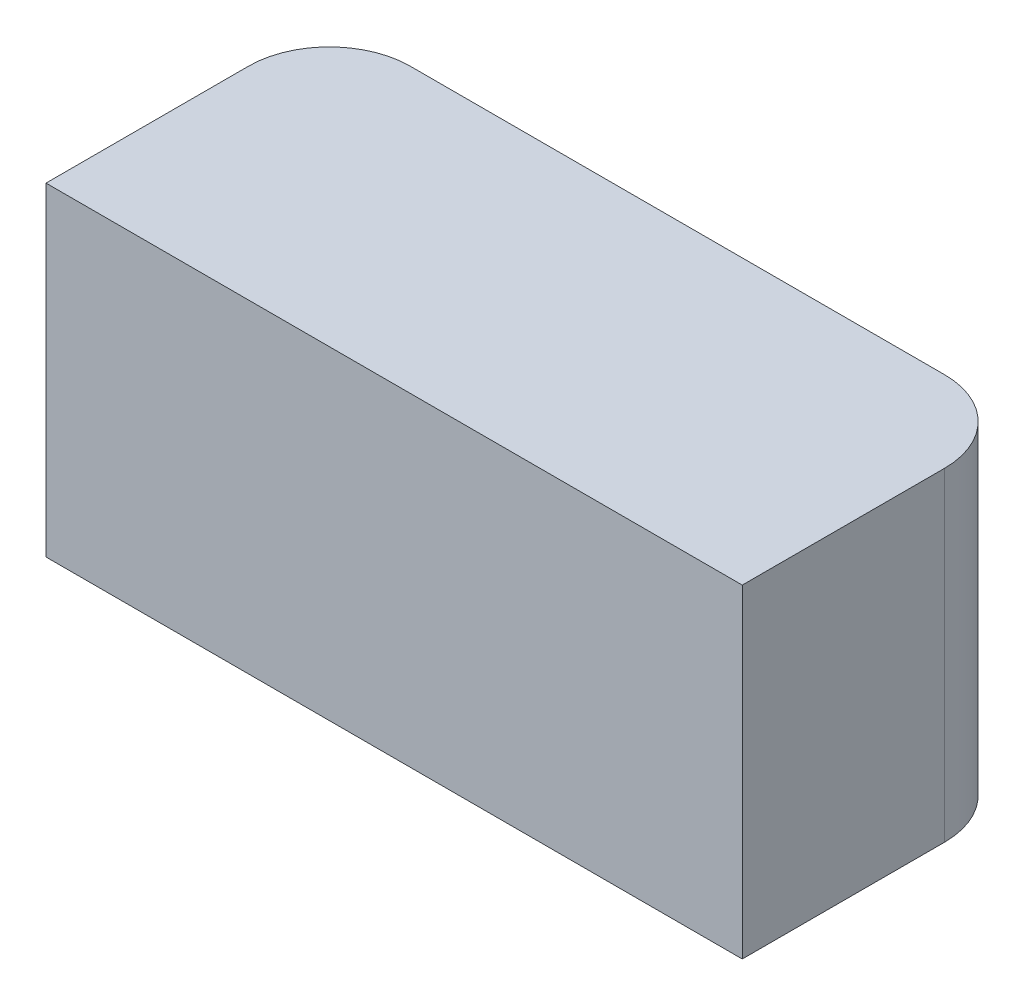
ISO-10303-21;
HEADER;
FILE_DESCRIPTION(('STEP AP214'),'2;1');
FILE_NAME('part.step','',(''),(''),'','','');
FILE_SCHEMA(('AUTOMOTIVE_DESIGN { 1 0 10303 214 1 1 1 1 }'));
ENDSEC;
DATA;
#1=APPLICATION_CONTEXT('core data for automotive mechanical design processes');
#2=APPLICATION_PROTOCOL_DEFINITION('international standard','automotive_design',2000,#1);
#3=PRODUCT_CONTEXT('',#1,'mechanical');
#4=PRODUCT('Part','Part','',(#3));
#5=PRODUCT_RELATED_PRODUCT_CATEGORY('part','',(#4));
#6=PRODUCT_DEFINITION_FORMATION('','',#4);
#7=PRODUCT_DEFINITION_CONTEXT('part definition',#1,'design');
#8=PRODUCT_DEFINITION('design','',#6,#7);
#9=PRODUCT_DEFINITION_SHAPE('','',#8);
#10=(LENGTH_UNIT() NAMED_UNIT(*) SI_UNIT(.MILLI.,.METRE.));
#11=(NAMED_UNIT(*) PLANE_ANGLE_UNIT() SI_UNIT($,.RADIAN.));
#12=(NAMED_UNIT(*) SI_UNIT($,.STERADIAN.) SOLID_ANGLE_UNIT());
#13=UNCERTAINTY_MEASURE_WITH_UNIT(LENGTH_MEASURE(1.E-05),#10,'distance_accuracy_value','');
#14=(GEOMETRIC_REPRESENTATION_CONTEXT(3) GLOBAL_UNCERTAINTY_ASSIGNED_CONTEXT((#13)) GLOBAL_UNIT_ASSIGNED_CONTEXT((#10,
#11,#12)) REPRESENTATION_CONTEXT('',''));
#15=CARTESIAN_POINT('',(0.,0.,0.));
#16=DIRECTION('',(0.,0.,1.));
#17=DIRECTION('',(1.,0.,0.));
#18=AXIS2_PLACEMENT_3D('',#15,#16,#17);
#19=CARTESIAN_POINT('',(-2.28,0.,2.875));
#20=DIRECTION('',(0.,-1.,0.));
#21=DIRECTION('',(0.,0.,-1.));
#22=AXIS2_PLACEMENT_3D('',#19,#20,#21);
#23=CYLINDRICAL_SURFACE('',#22,0.05);
#24=DIRECTION('',(0.,1.,0.));
#25=VECTOR('',#24,1.);
#26=CARTESIAN_POINT('',(-2.28,0.,2.825));
#27=LINE('',#26,#25);
#28=CARTESIAN_POINT('',(-2.28,0.2,2.825));
#29=VERTEX_POINT('',#28);
#30=CARTESIAN_POINT('',(-2.28,0.,2.825));
#31=VERTEX_POINT('',#30);
#32=EDGE_CURVE('E71',#29,#31,#27,.F.);
#33=ORIENTED_EDGE('',*,*,#32,.T.);
#34=CARTESIAN_POINT('',(-2.28,0.,2.875));
#35=DIRECTION('',(0.,-1.,0.));
#36=DIRECTION('',(0.,0.,-1.));
#37=AXIS2_PLACEMENT_3D('',#34,#35,#36);
#38=CIRCLE('',#37,0.05);
#39=CARTESIAN_POINT('',(-2.33,0.,2.875));
#40=VERTEX_POINT('',#39);
#41=EDGE_CURVE('E20',#40,#31,#38,.T.);
#42=ORIENTED_EDGE('',*,*,#41,.F.);
#43=DIRECTION('',(0.,1.,0.));
#44=VECTOR('',#43,1.);
#45=CARTESIAN_POINT('',(-2.33,0.,2.875));
#46=LINE('',#45,#44);
#47=CARTESIAN_POINT('',(-2.33,0.2,2.875));
#48=VERTEX_POINT('',#47);
#49=EDGE_CURVE('E69',#40,#48,#46,.T.);
#50=ORIENTED_EDGE('',*,*,#49,.T.);
#51=CARTESIAN_POINT('',(-2.28,0.2,2.875));
#52=DIRECTION('',(0.,-1.,0.));
#53=DIRECTION('',(0.,0.,-1.));
#54=AXIS2_PLACEMENT_3D('',#51,#52,#53);
#55=CIRCLE('',#54,0.05);
#56=EDGE_CURVE('E101',#48,#29,#55,.T.);
#57=ORIENTED_EDGE('',*,*,#56,.T.);
#58=EDGE_LOOP('',(#33,#42,#50,#57));
#59=FACE_BOUND('',#58,.T.);
#60=ADVANCED_FACE('F17',(#59),#23,.T.);
#61=CARTESIAN_POINT('',(-2.28,0.,2.825));
#62=DIRECTION('',(0.,0.,1.));
#63=DIRECTION('',(1.,0.,0.));
#64=AXIS2_PLACEMENT_3D('',#61,#62,#63);
#65=PLANE('',#64);
#66=DIRECTION('',(1.,0.,0.));
#67=VECTOR('',#66,1.);
#68=CARTESIAN_POINT('',(0.,0.2,2.825));
#69=LINE('',#68,#67);
#70=CARTESIAN_POINT('',(-1.95,0.2,2.825));
#71=VERTEX_POINT('',#70);
#72=EDGE_CURVE('E100',#29,#71,#69,.T.);
#73=ORIENTED_EDGE('',*,*,#72,.T.);
#74=DIRECTION('',(0.,-1.,0.));
#75=VECTOR('',#74,1.);
#76=CARTESIAN_POINT('',(-1.95,0.,2.825));
#77=LINE('',#76,#75);
#78=CARTESIAN_POINT('',(-1.95,0.,2.825));
#79=VERTEX_POINT('',#78);
#80=EDGE_CURVE('E76',#79,#71,#77,.F.);
#81=ORIENTED_EDGE('',*,*,#80,.F.);
#82=DIRECTION('',(1.,0.,0.));
#83=VECTOR('',#82,1.);
#84=CARTESIAN_POINT('',(0.,0.,2.825));
#85=LINE('',#84,#83);
#86=EDGE_CURVE('E75',#31,#79,#85,.T.);
#87=ORIENTED_EDGE('',*,*,#86,.F.);
#88=ORIENTED_EDGE('',*,*,#32,.F.);
#89=EDGE_LOOP('',(#73,#81,#87,#88));
#90=FACE_BOUND('',#89,.T.);
#91=ADVANCED_FACE('F138',(#90),#65,.F.);
#92=CARTESIAN_POINT('',(-1.95,0.,2.875));
#93=DIRECTION('',(0.,-1.,0.));
#94=DIRECTION('',(0.,0.,-1.));
#95=AXIS2_PLACEMENT_3D('',#92,#93,#94);
#96=CYLINDRICAL_SURFACE('',#95,0.05);
#97=DIRECTION('',(0.,1.,0.));
#98=VECTOR('',#97,1.);
#99=CARTESIAN_POINT('',(-1.9,0.,2.875));
#100=LINE('',#99,#98);
#101=CARTESIAN_POINT('',(-1.9,0.2,2.875));
#102=VERTEX_POINT('',#101);
#103=CARTESIAN_POINT('',(-1.9,0.,2.875));
#104=VERTEX_POINT('',#103);
#105=EDGE_CURVE('E109',#102,#104,#100,.F.);
#106=ORIENTED_EDGE('',*,*,#105,.T.);
#107=CARTESIAN_POINT('',(-1.95,0.,2.875));
#108=DIRECTION('',(0.,-1.,0.));
#109=DIRECTION('',(0.,0.,-1.));
#110=AXIS2_PLACEMENT_3D('',#107,#108,#109);
#111=CIRCLE('',#110,0.05);
#112=EDGE_CURVE('E89',#79,#104,#111,.T.);
#113=ORIENTED_EDGE('',*,*,#112,.F.);
#114=ORIENTED_EDGE('',*,*,#80,.T.);
#115=CARTESIAN_POINT('',(-1.95,0.2,2.875));
#116=DIRECTION('',(0.,-1.,0.));
#117=DIRECTION('',(0.,0.,-1.));
#118=AXIS2_PLACEMENT_3D('',#115,#116,#117);
#119=CIRCLE('',#118,0.05);
#120=EDGE_CURVE('E97',#71,#102,#119,.T.);
#121=ORIENTED_EDGE('',*,*,#120,.T.);
#122=EDGE_LOOP('',(#106,#113,#114,#121));
#123=FACE_BOUND('',#122,.T.);
#124=ADVANCED_FACE('F143',(#123),#96,.T.);
#125=CARTESIAN_POINT('',(0.,0.,0.));
#126=DIRECTION('',(0.,-1.,0.));
#127=DIRECTION('',(0.,0.,-1.));
#128=AXIS2_PLACEMENT_3D('',#125,#126,#127);
#129=PLANE('',#128);
#130=DIRECTION('',(0.,0.,1.));
#131=VECTOR('',#130,1.);
#132=CARTESIAN_POINT('',(-1.9,0.,2.875));
#133=LINE('',#132,#131);
#134=CARTESIAN_POINT('',(-1.9,0.,3.));
#135=VERTEX_POINT('',#134);
#136=EDGE_CURVE('E99',#104,#135,#133,.T.);
#137=ORIENTED_EDGE('',*,*,#136,.T.);
#138=DIRECTION('',(-1.,0.,0.));
#139=VECTOR('',#138,1.);
#140=CARTESIAN_POINT('',(-1.9,0.,3.));
#141=LINE('',#140,#139);
#142=CARTESIAN_POINT('',(-2.33,0.,3.));
#143=VERTEX_POINT('',#142);
#144=EDGE_CURVE('E88',#135,#143,#141,.T.);
#145=ORIENTED_EDGE('',*,*,#144,.T.);
#146=DIRECTION('',(0.,0.,-1.));
#147=VECTOR('',#146,1.);
#148=CARTESIAN_POINT('',(-2.33,0.,3.));
#149=LINE('',#148,#147);
#150=EDGE_CURVE('E81',#143,#40,#149,.T.);
#151=ORIENTED_EDGE('',*,*,#150,.T.);
#152=ORIENTED_EDGE('',*,*,#41,.T.);
#153=ORIENTED_EDGE('',*,*,#86,.T.);
#154=ORIENTED_EDGE('',*,*,#112,.T.);
#155=EDGE_LOOP('',(#137,#145,#151,#152,#153,#154));
#156=FACE_BOUND('',#155,.T.);
#157=ADVANCED_FACE('F87',(#156),#129,.T.);
#158=CARTESIAN_POINT('',(-2.33,0.,3.));
#159=DIRECTION('',(1.,0.,0.));
#160=DIRECTION('',(0.,0.,-1.));
#161=AXIS2_PLACEMENT_3D('',#158,#159,#160);
#162=PLANE('',#161);
#163=DIRECTION('',(0.,0.,-1.));
#164=VECTOR('',#163,1.);
#165=CARTESIAN_POINT('',(-2.33,0.2,0.));
#166=LINE('',#165,#164);
#167=CARTESIAN_POINT('',(-2.33,0.2,3.));
#168=VERTEX_POINT('',#167);
#169=EDGE_CURVE('E83',#168,#48,#166,.T.);
#170=ORIENTED_EDGE('',*,*,#169,.T.);
#171=ORIENTED_EDGE('',*,*,#49,.F.);
#172=ORIENTED_EDGE('',*,*,#150,.F.);
#173=DIRECTION('',(0.,1.,0.));
#174=VECTOR('',#173,1.);
#175=CARTESIAN_POINT('',(-2.33,0.,3.));
#176=LINE('',#175,#174);
#177=EDGE_CURVE('E119',#143,#168,#176,.T.);
#178=ORIENTED_EDGE('',*,*,#177,.T.);
#179=EDGE_LOOP('',(#170,#171,#172,#178));
#180=FACE_BOUND('',#179,.T.);
#181=ADVANCED_FACE('F79',(#180),#162,.F.);
#182=CARTESIAN_POINT('',(0.,0.2,0.));
#183=DIRECTION('',(0.,-1.,0.));
#184=DIRECTION('',(0.,0.,-1.));
#185=AXIS2_PLACEMENT_3D('',#182,#183,#184);
#186=PLANE('',#185);
#187=ORIENTED_EDGE('',*,*,#120,.F.);
#188=ORIENTED_EDGE('',*,*,#72,.F.);
#189=ORIENTED_EDGE('',*,*,#56,.F.);
#190=ORIENTED_EDGE('',*,*,#169,.F.);
#191=DIRECTION('',(-1.,0.,0.));
#192=VECTOR('',#191,1.);
#193=CARTESIAN_POINT('',(-1.9,0.2,3.));
#194=LINE('',#193,#192);
#195=CARTESIAN_POINT('',(-1.9,0.2,3.));
#196=VERTEX_POINT('',#195);
#197=EDGE_CURVE('E26',#168,#196,#194,.F.);
#198=ORIENTED_EDGE('',*,*,#197,.T.);
#199=DIRECTION('',(0.,0.,1.));
#200=VECTOR('',#199,1.);
#201=CARTESIAN_POINT('',(-1.9,0.2,2.875));
#202=LINE('',#201,#200);
#203=EDGE_CURVE('E34',#196,#102,#202,.F.);
#204=ORIENTED_EDGE('',*,*,#203,.T.);
#205=EDGE_LOOP('',(#187,#188,#189,#190,#198,#204));
#206=FACE_BOUND('',#205,.T.);
#207=ADVANCED_FACE('F134',(#206),#186,.F.);
#208=CARTESIAN_POINT('',(-1.9,0.,2.875));
#209=DIRECTION('',(-1.,0.,0.));
#210=DIRECTION('',(0.,0.,1.));
#211=AXIS2_PLACEMENT_3D('',#208,#209,#210);
#212=PLANE('',#211);
#213=ORIENTED_EDGE('',*,*,#203,.F.);
#214=DIRECTION('',(0.,1.,0.));
#215=VECTOR('',#214,1.);
#216=CARTESIAN_POINT('',(-1.9,0.,3.));
#217=LINE('',#216,#215);
#218=EDGE_CURVE('E11',#196,#135,#217,.F.);
#219=ORIENTED_EDGE('',*,*,#218,.T.);
#220=ORIENTED_EDGE('',*,*,#136,.F.);
#221=ORIENTED_EDGE('',*,*,#105,.F.);
#222=EDGE_LOOP('',(#213,#219,#220,#221));
#223=FACE_BOUND('',#222,.T.);
#224=ADVANCED_FACE('F142',(#223),#212,.F.);
#225=CARTESIAN_POINT('',(-1.9,0.,3.));
#226=DIRECTION('',(0.,0.,-1.));
#227=DIRECTION('',(-1.,0.,0.));
#228=AXIS2_PLACEMENT_3D('',#225,#226,#227);
#229=PLANE('',#228);
#230=ORIENTED_EDGE('',*,*,#197,.F.);
#231=ORIENTED_EDGE('',*,*,#177,.F.);
#232=ORIENTED_EDGE('',*,*,#144,.F.);
#233=ORIENTED_EDGE('',*,*,#218,.F.);
#234=EDGE_LOOP('',(#230,#231,#232,#233));
#235=FACE_BOUND('',#234,.T.);
#236=ADVANCED_FACE('F131',(#235),#229,.F.);
#237=CLOSED_SHELL('',(#60,#91,#124,#157,#181,#207,#224,#236));
#238=MANIFOLD_SOLID_BREP('B1',#237);
#239=ADVANCED_BREP_SHAPE_REPRESENTATION('',(#18,#238),#14);
#240=SHAPE_DEFINITION_REPRESENTATION(#9,#239);
ENDSEC;
END-ISO-10303-21;
